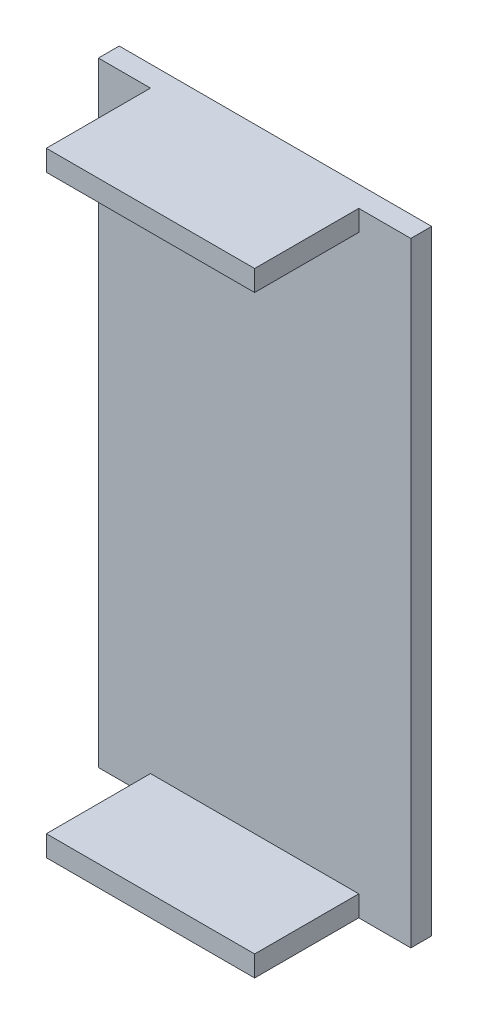
ISO-10303-21;
HEADER;
FILE_DESCRIPTION(('STEP AP214'),'2;1');
FILE_NAME('part.step','',(''),(''),'','','');
FILE_SCHEMA(('AUTOMOTIVE_DESIGN { 1 0 10303 214 1 1 1 1 }'));
ENDSEC;
DATA;
#1=APPLICATION_CONTEXT('core data for automotive mechanical design processes');
#2=APPLICATION_PROTOCOL_DEFINITION('international standard','automotive_design',2000,#1);
#3=PRODUCT_CONTEXT('',#1,'mechanical');
#4=PRODUCT('Part','Part','',(#3));
#5=PRODUCT_RELATED_PRODUCT_CATEGORY('part','',(#4));
#6=PRODUCT_DEFINITION_FORMATION('','',#4);
#7=PRODUCT_DEFINITION_CONTEXT('part definition',#1,'design');
#8=PRODUCT_DEFINITION('design','',#6,#7);
#9=PRODUCT_DEFINITION_SHAPE('','',#8);
#10=(LENGTH_UNIT() NAMED_UNIT(*) SI_UNIT(.MILLI.,.METRE.));
#11=(NAMED_UNIT(*) PLANE_ANGLE_UNIT() SI_UNIT($,.RADIAN.));
#12=(NAMED_UNIT(*) SI_UNIT($,.STERADIAN.) SOLID_ANGLE_UNIT());
#13=UNCERTAINTY_MEASURE_WITH_UNIT(LENGTH_MEASURE(1.E-05),#10,'distance_accuracy_value','');
#14=(GEOMETRIC_REPRESENTATION_CONTEXT(3) GLOBAL_UNCERTAINTY_ASSIGNED_CONTEXT((#13)) GLOBAL_UNIT_ASSIGNED_CONTEXT((#10,
#11,#12)) REPRESENTATION_CONTEXT('',''));
#15=CARTESIAN_POINT('',(0.,0.,0.));
#16=DIRECTION('',(0.,0.,1.));
#17=DIRECTION('',(1.,0.,0.));
#18=AXIS2_PLACEMENT_3D('',#15,#16,#17);
#19=CARTESIAN_POINT('',(0.,0.,2.));
#20=DIRECTION('',(1.,0.,0.));
#21=DIRECTION('',(0.,0.,-1.));
#22=AXIS2_PLACEMENT_3D('',#19,#20,#21);
#23=PLANE('',#22);
#24=DIRECTION('',(0.,-1.,0.));
#25=VECTOR('',#24,1.);
#26=CARTESIAN_POINT('',(0.,0.,0.));
#27=LINE('',#26,#25);
#28=CARTESIAN_POINT('',(0.,59.,0.));
#29=VERTEX_POINT('',#28);
#30=CARTESIAN_POINT('',(0.,0.,0.));
#31=VERTEX_POINT('',#30);
#32=EDGE_CURVE('E186',#29,#31,#27,.T.);
#33=ORIENTED_EDGE('',*,*,#32,.T.);
#34=DIRECTION('',(0.,0.,-1.));
#35=VECTOR('',#34,1.);
#36=CARTESIAN_POINT('',(0.,0.,2.));
#37=LINE('',#36,#35);
#38=CARTESIAN_POINT('',(0.,0.,2.));
#39=VERTEX_POINT('',#38);
#40=EDGE_CURVE('E11',#39,#31,#37,.T.);
#41=ORIENTED_EDGE('',*,*,#40,.F.);
#42=DIRECTION('',(0.,-1.,0.));
#43=VECTOR('',#42,1.);
#44=CARTESIAN_POINT('',(0.,0.,2.));
#45=LINE('',#44,#43);
#46=CARTESIAN_POINT('',(0.,59.,2.));
#47=VERTEX_POINT('',#46);
#48=EDGE_CURVE('E187',#47,#39,#45,.T.);
#49=ORIENTED_EDGE('',*,*,#48,.F.);
#50=DIRECTION('',(0.,0.,-1.));
#51=VECTOR('',#50,1.);
#52=CARTESIAN_POINT('',(0.,59.,2.));
#53=LINE('',#52,#51);
#54=EDGE_CURVE('E199',#47,#29,#53,.T.);
#55=ORIENTED_EDGE('',*,*,#54,.T.);
#56=EDGE_LOOP('',(#33,#41,#49,#55));
#57=FACE_BOUND('',#56,.T.);
#58=ADVANCED_FACE('F35',(#57),#23,.F.);
#59=CARTESIAN_POINT('',(0.,0.,2.));
#60=DIRECTION('',(0.,1.,0.));
#61=DIRECTION('',(0.,0.,1.));
#62=AXIS2_PLACEMENT_3D('',#59,#60,#61);
#63=PLANE('',#62);
#64=DIRECTION('',(1.,0.,0.));
#65=VECTOR('',#64,1.);
#66=CARTESIAN_POINT('',(0.,0.,0.));
#67=LINE('',#66,#65);
#68=CARTESIAN_POINT('',(30.,0.,0.));
#69=VERTEX_POINT('',#68);
#70=EDGE_CURVE('E202',#31,#69,#67,.T.);
#71=ORIENTED_EDGE('',*,*,#70,.T.);
#72=DIRECTION('',(0.,0.,-1.));
#73=VECTOR('',#72,1.);
#74=CARTESIAN_POINT('',(30.,0.,2.));
#75=LINE('',#74,#73);
#76=CARTESIAN_POINT('',(30.,0.,2.));
#77=VERTEX_POINT('',#76);
#78=EDGE_CURVE('E42',#77,#69,#75,.T.);
#79=ORIENTED_EDGE('',*,*,#78,.F.);
#80=DIRECTION('',(1.,0.,0.));
#81=VECTOR('',#80,1.);
#82=CARTESIAN_POINT('',(0.,0.,2.));
#83=LINE('',#82,#81);
#84=CARTESIAN_POINT('',(25.,0.,2.));
#85=VERTEX_POINT('',#84);
#86=EDGE_CURVE('E190',#85,#77,#83,.T.);
#87=ORIENTED_EDGE('',*,*,#86,.F.);
#88=DIRECTION('',(0.,0.,-1.));
#89=VECTOR('',#88,1.);
#90=CARTESIAN_POINT('',(25.,0.,12.));
#91=LINE('',#90,#89);
#92=CARTESIAN_POINT('',(25.,0.,12.));
#93=VERTEX_POINT('',#92);
#94=EDGE_CURVE('E131',#93,#85,#91,.T.);
#95=ORIENTED_EDGE('',*,*,#94,.F.);
#96=DIRECTION('',(1.,0.,0.));
#97=VECTOR('',#96,1.);
#98=CARTESIAN_POINT('',(0.,0.,12.));
#99=LINE('',#98,#97);
#100=CARTESIAN_POINT('',(5.,0.,12.));
#101=VERTEX_POINT('',#100);
#102=EDGE_CURVE('E134',#101,#93,#99,.T.);
#103=ORIENTED_EDGE('',*,*,#102,.F.);
#104=DIRECTION('',(0.,0.,-1.));
#105=VECTOR('',#104,1.);
#106=CARTESIAN_POINT('',(5.,0.,12.));
#107=LINE('',#106,#105);
#108=CARTESIAN_POINT('',(5.,0.,2.));
#109=VERTEX_POINT('',#108);
#110=EDGE_CURVE('E122',#101,#109,#107,.T.);
#111=ORIENTED_EDGE('',*,*,#110,.T.);
#112=EDGE_CURVE('E192',#39,#109,#83,.T.);
#113=ORIENTED_EDGE('',*,*,#112,.F.);
#114=ORIENTED_EDGE('',*,*,#40,.T.);
#115=EDGE_LOOP('',(#71,#79,#87,#95,#103,#111,#113,#114));
#116=FACE_BOUND('',#115,.T.);
#117=ADVANCED_FACE('F135',(#116),#63,.F.);
#118=CARTESIAN_POINT('',(30.,0.,2.));
#119=DIRECTION('',(-1.,0.,0.));
#120=DIRECTION('',(0.,0.,1.));
#121=AXIS2_PLACEMENT_3D('',#118,#119,#120);
#122=PLANE('',#121);
#123=DIRECTION('',(0.,1.,0.));
#124=VECTOR('',#123,1.);
#125=CARTESIAN_POINT('',(30.,0.,0.));
#126=LINE('',#125,#124);
#127=CARTESIAN_POINT('',(30.,59.,0.));
#128=VERTEX_POINT('',#127);
#129=EDGE_CURVE('E204',#69,#128,#126,.T.);
#130=ORIENTED_EDGE('',*,*,#129,.T.);
#131=DIRECTION('',(0.,0.,-1.));
#132=VECTOR('',#131,1.);
#133=CARTESIAN_POINT('',(30.,59.,2.));
#134=LINE('',#133,#132);
#135=CARTESIAN_POINT('',(30.,59.,2.));
#136=VERTEX_POINT('',#135);
#137=EDGE_CURVE('E209',#136,#128,#134,.T.);
#138=ORIENTED_EDGE('',*,*,#137,.F.);
#139=DIRECTION('',(0.,1.,0.));
#140=VECTOR('',#139,1.);
#141=CARTESIAN_POINT('',(30.,0.,2.));
#142=LINE('',#141,#140);
#143=EDGE_CURVE('E194',#77,#136,#142,.T.);
#144=ORIENTED_EDGE('',*,*,#143,.F.);
#145=ORIENTED_EDGE('',*,*,#78,.T.);
#146=EDGE_LOOP('',(#130,#138,#144,#145));
#147=FACE_BOUND('',#146,.T.);
#148=ADVANCED_FACE('F216',(#147),#122,.F.);
#149=CARTESIAN_POINT('',(0.,59.,2.));
#150=DIRECTION('',(0.,-1.,0.));
#151=DIRECTION('',(0.,0.,-1.));
#152=AXIS2_PLACEMENT_3D('',#149,#150,#151);
#153=PLANE('',#152);
#154=DIRECTION('',(-1.,0.,0.));
#155=VECTOR('',#154,1.);
#156=CARTESIAN_POINT('',(0.,59.,0.));
#157=LINE('',#156,#155);
#158=EDGE_CURVE('E191',#128,#29,#157,.T.);
#159=ORIENTED_EDGE('',*,*,#158,.T.);
#160=ORIENTED_EDGE('',*,*,#54,.F.);
#161=DIRECTION('',(-1.,0.,0.));
#162=VECTOR('',#161,1.);
#163=CARTESIAN_POINT('',(0.,59.,2.));
#164=LINE('',#163,#162);
#165=CARTESIAN_POINT('',(5.,59.,2.));
#166=VERTEX_POINT('',#165);
#167=EDGE_CURVE('E196',#166,#47,#164,.T.);
#168=ORIENTED_EDGE('',*,*,#167,.F.);
#169=DIRECTION('',(0.,0.,-1.));
#170=VECTOR('',#169,1.);
#171=CARTESIAN_POINT('',(5.,59.,12.));
#172=LINE('',#171,#170);
#173=CARTESIAN_POINT('',(5.,59.,12.));
#174=VERTEX_POINT('',#173);
#175=EDGE_CURVE('E180',#174,#166,#172,.T.);
#176=ORIENTED_EDGE('',*,*,#175,.F.);
#177=DIRECTION('',(-1.,0.,0.));
#178=VECTOR('',#177,1.);
#179=CARTESIAN_POINT('',(0.,59.,12.));
#180=LINE('',#179,#178);
#181=CARTESIAN_POINT('',(25.,59.,12.));
#182=VERTEX_POINT('',#181);
#183=EDGE_CURVE('E161',#182,#174,#180,.T.);
#184=ORIENTED_EDGE('',*,*,#183,.F.);
#185=DIRECTION('',(0.,0.,-1.));
#186=VECTOR('',#185,1.);
#187=CARTESIAN_POINT('',(25.,59.,12.));
#188=LINE('',#187,#186);
#189=CARTESIAN_POINT('',(25.,59.,2.));
#190=VERTEX_POINT('',#189);
#191=EDGE_CURVE('E183',#182,#190,#188,.T.);
#192=ORIENTED_EDGE('',*,*,#191,.T.);
#193=EDGE_CURVE('E197',#136,#190,#164,.T.);
#194=ORIENTED_EDGE('',*,*,#193,.F.);
#195=ORIENTED_EDGE('',*,*,#137,.T.);
#196=EDGE_LOOP('',(#159,#160,#168,#176,#184,#192,#194,#195));
#197=FACE_BOUND('',#196,.T.);
#198=ADVANCED_FACE('F224',(#197),#153,.F.);
#199=CARTESIAN_POINT('',(0.,0.,2.));
#200=DIRECTION('',(0.,0.,-1.));
#201=DIRECTION('',(-1.,0.,0.));
#202=AXIS2_PLACEMENT_3D('',#199,#200,#201);
#203=PLANE('',#202);
#204=ORIENTED_EDGE('',*,*,#112,.T.);
#205=DIRECTION('',(0.,1.,0.));
#206=VECTOR('',#205,1.);
#207=CARTESIAN_POINT('',(5.,0.,2.));
#208=LINE('',#207,#206);
#209=CARTESIAN_POINT('',(5.,2.,2.));
#210=VERTEX_POINT('',#209);
#211=EDGE_CURVE('E128',#109,#210,#208,.T.);
#212=ORIENTED_EDGE('',*,*,#211,.T.);
#213=DIRECTION('',(-1.,0.,0.));
#214=VECTOR('',#213,1.);
#215=CARTESIAN_POINT('',(0.,2.,2.));
#216=LINE('',#215,#214);
#217=CARTESIAN_POINT('',(25.,2.,2.));
#218=VERTEX_POINT('',#217);
#219=EDGE_CURVE('E49',#218,#210,#216,.T.);
#220=ORIENTED_EDGE('',*,*,#219,.F.);
#221=DIRECTION('',(0.,1.,0.));
#222=VECTOR('',#221,1.);
#223=CARTESIAN_POINT('',(25.,0.,2.));
#224=LINE('',#223,#222);
#225=EDGE_CURVE('E53',#85,#218,#224,.T.);
#226=ORIENTED_EDGE('',*,*,#225,.F.);
#227=ORIENTED_EDGE('',*,*,#86,.T.);
#228=ORIENTED_EDGE('',*,*,#143,.T.);
#229=ORIENTED_EDGE('',*,*,#193,.T.);
#230=DIRECTION('',(0.,-1.,0.));
#231=VECTOR('',#230,1.);
#232=CARTESIAN_POINT('',(25.,0.,2.));
#233=LINE('',#232,#231);
#234=CARTESIAN_POINT('',(25.,57.,2.));
#235=VERTEX_POINT('',#234);
#236=EDGE_CURVE('E130',#190,#235,#233,.T.);
#237=ORIENTED_EDGE('',*,*,#236,.T.);
#238=DIRECTION('',(1.,0.,0.));
#239=VECTOR('',#238,1.);
#240=CARTESIAN_POINT('',(0.,57.,2.));
#241=LINE('',#240,#239);
#242=CARTESIAN_POINT('',(5.,57.,2.));
#243=VERTEX_POINT('',#242);
#244=EDGE_CURVE('E162',#243,#235,#241,.T.);
#245=ORIENTED_EDGE('',*,*,#244,.F.);
#246=DIRECTION('',(0.,-1.,0.));
#247=VECTOR('',#246,1.);
#248=CARTESIAN_POINT('',(5.,0.,2.));
#249=LINE('',#248,#247);
#250=EDGE_CURVE('E170',#166,#243,#249,.T.);
#251=ORIENTED_EDGE('',*,*,#250,.F.);
#252=ORIENTED_EDGE('',*,*,#167,.T.);
#253=ORIENTED_EDGE('',*,*,#48,.T.);
#254=EDGE_LOOP('',(#204,#212,#220,#226,#227,#228,#229,#237,#245,#251,#252,#253));
#255=FACE_BOUND('',#254,.T.);
#256=ADVANCED_FACE('F230',(#255),#203,.F.);
#257=CARTESIAN_POINT('',(0.,0.,0.));
#258=DIRECTION('',(0.,0.,-1.));
#259=DIRECTION('',(-1.,0.,0.));
#260=AXIS2_PLACEMENT_3D('',#257,#258,#259);
#261=PLANE('',#260);
#262=ORIENTED_EDGE('',*,*,#32,.F.);
#263=ORIENTED_EDGE('',*,*,#158,.F.);
#264=ORIENTED_EDGE('',*,*,#129,.F.);
#265=ORIENTED_EDGE('',*,*,#70,.F.);
#266=EDGE_LOOP('',(#262,#263,#264,#265));
#267=FACE_BOUND('',#266,.T.);
#268=ADVANCED_FACE('F221',(#267),#261,.T.);
#269=CARTESIAN_POINT('',(25.,0.,12.));
#270=DIRECTION('',(1.,0.,0.));
#271=DIRECTION('',(0.,0.,-1.));
#272=AXIS2_PLACEMENT_3D('',#269,#270,#271);
#273=PLANE('',#272);
#274=ORIENTED_EDGE('',*,*,#236,.F.);
#275=ORIENTED_EDGE('',*,*,#191,.F.);
#276=DIRECTION('',(0.,-1.,0.));
#277=VECTOR('',#276,1.);
#278=CARTESIAN_POINT('',(25.,0.,12.));
#279=LINE('',#278,#277);
#280=CARTESIAN_POINT('',(25.,57.,12.));
#281=VERTEX_POINT('',#280);
#282=EDGE_CURVE('E158',#182,#281,#279,.T.);
#283=ORIENTED_EDGE('',*,*,#282,.T.);
#284=DIRECTION('',(0.,0.,-1.));
#285=VECTOR('',#284,1.);
#286=CARTESIAN_POINT('',(25.,57.,12.));
#287=LINE('',#286,#285);
#288=EDGE_CURVE('E168',#281,#235,#287,.T.);
#289=ORIENTED_EDGE('',*,*,#288,.T.);
#290=EDGE_LOOP('',(#274,#275,#283,#289));
#291=FACE_BOUND('',#290,.T.);
#292=ADVANCED_FACE('F244',(#291),#273,.T.);
#293=CARTESIAN_POINT('',(5.,0.,12.));
#294=DIRECTION('',(1.,0.,0.));
#295=DIRECTION('',(0.,0.,-1.));
#296=AXIS2_PLACEMENT_3D('',#293,#294,#295);
#297=PLANE('',#296);
#298=ORIENTED_EDGE('',*,*,#250,.T.);
#299=DIRECTION('',(0.,0.,-1.));
#300=VECTOR('',#299,1.);
#301=CARTESIAN_POINT('',(5.,57.,12.));
#302=LINE('',#301,#300);
#303=CARTESIAN_POINT('',(5.,57.,12.));
#304=VERTEX_POINT('',#303);
#305=EDGE_CURVE('E177',#304,#243,#302,.T.);
#306=ORIENTED_EDGE('',*,*,#305,.F.);
#307=DIRECTION('',(0.,-1.,0.));
#308=VECTOR('',#307,1.);
#309=CARTESIAN_POINT('',(5.,0.,12.));
#310=LINE('',#309,#308);
#311=EDGE_CURVE('E164',#174,#304,#310,.T.);
#312=ORIENTED_EDGE('',*,*,#311,.F.);
#313=ORIENTED_EDGE('',*,*,#175,.T.);
#314=EDGE_LOOP('',(#298,#306,#312,#313));
#315=FACE_BOUND('',#314,.T.);
#316=ADVANCED_FACE('F235',(#315),#297,.F.);
#317=CARTESIAN_POINT('',(0.,57.,12.));
#318=DIRECTION('',(0.,1.,0.));
#319=DIRECTION('',(0.,0.,1.));
#320=AXIS2_PLACEMENT_3D('',#317,#318,#319);
#321=PLANE('',#320);
#322=ORIENTED_EDGE('',*,*,#244,.T.);
#323=ORIENTED_EDGE('',*,*,#288,.F.);
#324=DIRECTION('',(1.,0.,0.));
#325=VECTOR('',#324,1.);
#326=CARTESIAN_POINT('',(0.,57.,12.));
#327=LINE('',#326,#325);
#328=EDGE_CURVE('E166',#304,#281,#327,.T.);
#329=ORIENTED_EDGE('',*,*,#328,.F.);
#330=ORIENTED_EDGE('',*,*,#305,.T.);
#331=EDGE_LOOP('',(#322,#323,#329,#330));
#332=FACE_BOUND('',#331,.T.);
#333=ADVANCED_FACE('F277',(#332),#321,.F.);
#334=CARTESIAN_POINT('',(0.,0.,12.));
#335=DIRECTION('',(0.,0.,1.));
#336=DIRECTION('',(1.,0.,0.));
#337=AXIS2_PLACEMENT_3D('',#334,#335,#336);
#338=PLANE('',#337);
#339=ORIENTED_EDGE('',*,*,#282,.F.);
#340=ORIENTED_EDGE('',*,*,#183,.T.);
#341=ORIENTED_EDGE('',*,*,#311,.T.);
#342=ORIENTED_EDGE('',*,*,#328,.T.);
#343=EDGE_LOOP('',(#339,#340,#341,#342));
#344=FACE_BOUND('',#343,.T.);
#345=ADVANCED_FACE('F240',(#344),#338,.T.);
#346=CARTESIAN_POINT('',(5.,0.,12.));
#347=DIRECTION('',(-1.,0.,0.));
#348=DIRECTION('',(0.,0.,1.));
#349=AXIS2_PLACEMENT_3D('',#346,#347,#348);
#350=PLANE('',#349);
#351=ORIENTED_EDGE('',*,*,#211,.F.);
#352=ORIENTED_EDGE('',*,*,#110,.F.);
#353=DIRECTION('',(0.,1.,0.));
#354=VECTOR('',#353,1.);
#355=CARTESIAN_POINT('',(5.,0.,12.));
#356=LINE('',#355,#354);
#357=CARTESIAN_POINT('',(5.,2.,12.));
#358=VERTEX_POINT('',#357);
#359=EDGE_CURVE('E127',#101,#358,#356,.T.);
#360=ORIENTED_EDGE('',*,*,#359,.T.);
#361=DIRECTION('',(0.,0.,-1.));
#362=VECTOR('',#361,1.);
#363=CARTESIAN_POINT('',(5.,2.,12.));
#364=LINE('',#363,#362);
#365=EDGE_CURVE('E150',#358,#210,#364,.T.);
#366=ORIENTED_EDGE('',*,*,#365,.T.);
#367=EDGE_LOOP('',(#351,#352,#360,#366));
#368=FACE_BOUND('',#367,.T.);
#369=ADVANCED_FACE('F124',(#368),#350,.T.);
#370=CARTESIAN_POINT('',(25.,0.,12.));
#371=DIRECTION('',(-1.,0.,0.));
#372=DIRECTION('',(0.,0.,1.));
#373=AXIS2_PLACEMENT_3D('',#370,#371,#372);
#374=PLANE('',#373);
#375=ORIENTED_EDGE('',*,*,#225,.T.);
#376=DIRECTION('',(0.,0.,-1.));
#377=VECTOR('',#376,1.);
#378=CARTESIAN_POINT('',(25.,2.,12.));
#379=LINE('',#378,#377);
#380=CARTESIAN_POINT('',(25.,2.,12.));
#381=VERTEX_POINT('',#380);
#382=EDGE_CURVE('E154',#381,#218,#379,.T.);
#383=ORIENTED_EDGE('',*,*,#382,.F.);
#384=DIRECTION('',(0.,1.,0.));
#385=VECTOR('',#384,1.);
#386=CARTESIAN_POINT('',(25.,0.,12.));
#387=LINE('',#386,#385);
#388=EDGE_CURVE('E139',#93,#381,#387,.T.);
#389=ORIENTED_EDGE('',*,*,#388,.F.);
#390=ORIENTED_EDGE('',*,*,#94,.T.);
#391=EDGE_LOOP('',(#375,#383,#389,#390));
#392=FACE_BOUND('',#391,.T.);
#393=ADVANCED_FACE('F246',(#392),#374,.F.);
#394=CARTESIAN_POINT('',(0.,2.,12.));
#395=DIRECTION('',(0.,-1.,0.));
#396=DIRECTION('',(1.,0.,0.));
#397=AXIS2_PLACEMENT_3D('',#394,#395,#396);
#398=PLANE('',#397);
#399=ORIENTED_EDGE('',*,*,#219,.T.);
#400=ORIENTED_EDGE('',*,*,#365,.F.);
#401=DIRECTION('',(-1.,0.,0.));
#402=VECTOR('',#401,1.);
#403=CARTESIAN_POINT('',(0.,2.,12.));
#404=LINE('',#403,#402);
#405=EDGE_CURVE('E143',#381,#358,#404,.T.);
#406=ORIENTED_EDGE('',*,*,#405,.F.);
#407=ORIENTED_EDGE('',*,*,#382,.T.);
#408=EDGE_LOOP('',(#399,#400,#406,#407));
#409=FACE_BOUND('',#408,.T.);
#410=ADVANCED_FACE('F249',(#409),#398,.F.);
#411=CARTESIAN_POINT('',(0.,0.,12.));
#412=DIRECTION('',(0.,0.,1.));
#413=DIRECTION('',(1.,0.,0.));
#414=AXIS2_PLACEMENT_3D('',#411,#412,#413);
#415=PLANE('',#414);
#416=ORIENTED_EDGE('',*,*,#359,.F.);
#417=ORIENTED_EDGE('',*,*,#102,.T.);
#418=ORIENTED_EDGE('',*,*,#388,.T.);
#419=ORIENTED_EDGE('',*,*,#405,.T.);
#420=EDGE_LOOP('',(#416,#417,#418,#419));
#421=FACE_BOUND('',#420,.T.);
#422=ADVANCED_FACE('F141',(#421),#415,.T.);
#423=CLOSED_SHELL('',(#58,#117,#148,#198,#256,#268,#292,#316,#333,#345,#369,#393,#410,#422));
#424=MANIFOLD_SOLID_BREP('B2',#423);
#425=ADVANCED_BREP_SHAPE_REPRESENTATION('',(#18,#424),#14);
#426=SHAPE_DEFINITION_REPRESENTATION(#9,#425);
ENDSEC;
END-ISO-10303-21;
